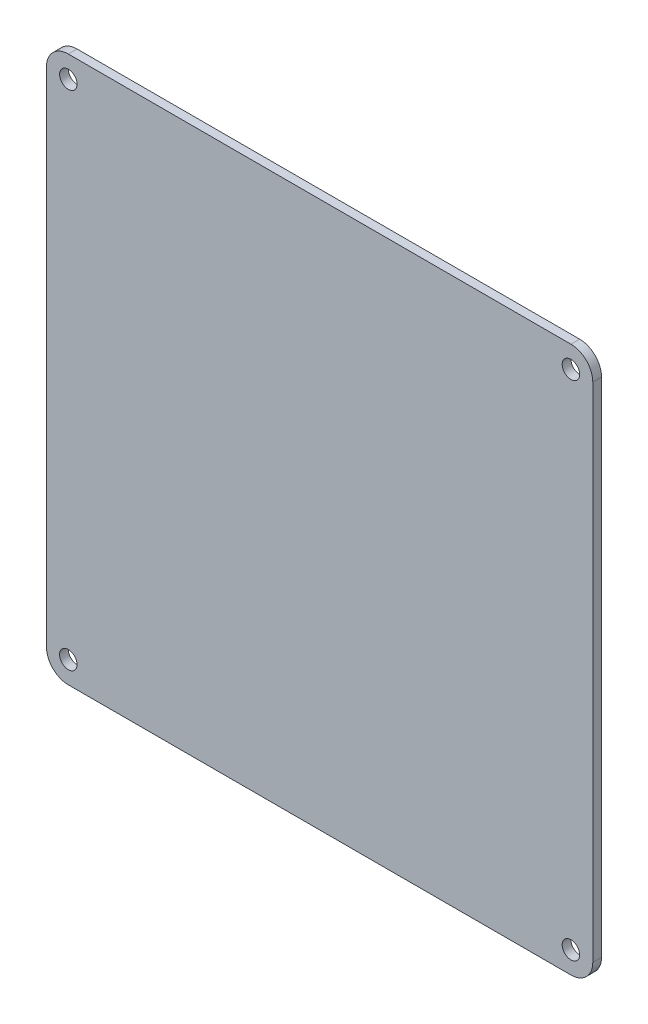
ISO-10303-21;
HEADER;
FILE_DESCRIPTION(('STEP AP214'),'2;1');
FILE_NAME('part.step','',(''),(''),'','','');
FILE_SCHEMA(('AUTOMOTIVE_DESIGN { 1 0 10303 214 1 1 1 1 }'));
ENDSEC;
DATA;
#1=APPLICATION_CONTEXT('core data for automotive mechanical design processes');
#2=APPLICATION_PROTOCOL_DEFINITION('international standard','automotive_design',2000,#1);
#3=PRODUCT_CONTEXT('',#1,'mechanical');
#4=PRODUCT('Part','Part','',(#3));
#5=PRODUCT_RELATED_PRODUCT_CATEGORY('part','',(#4));
#6=PRODUCT_DEFINITION_FORMATION('','',#4);
#7=PRODUCT_DEFINITION_CONTEXT('part definition',#1,'design');
#8=PRODUCT_DEFINITION('design','',#6,#7);
#9=PRODUCT_DEFINITION_SHAPE('','',#8);
#10=(LENGTH_UNIT() NAMED_UNIT(*) SI_UNIT(.MILLI.,.METRE.));
#11=(NAMED_UNIT(*) PLANE_ANGLE_UNIT() SI_UNIT($,.RADIAN.));
#12=(NAMED_UNIT(*) SI_UNIT($,.STERADIAN.) SOLID_ANGLE_UNIT());
#13=UNCERTAINTY_MEASURE_WITH_UNIT(LENGTH_MEASURE(1.E-05),#10,'distance_accuracy_value','');
#14=(GEOMETRIC_REPRESENTATION_CONTEXT(3) GLOBAL_UNCERTAINTY_ASSIGNED_CONTEXT((#13)) GLOBAL_UNIT_ASSIGNED_CONTEXT((#10,
#11,#12)) REPRESENTATION_CONTEXT('',''));
#15=CARTESIAN_POINT('',(0.,0.,0.));
#16=DIRECTION('',(0.,0.,1.));
#17=DIRECTION('',(1.,0.,0.));
#18=AXIS2_PLACEMENT_3D('',#15,#16,#17);
#19=CARTESIAN_POINT('',(46.,-46.,1.6));
#20=DIRECTION('',(0.,0.,-1.));
#21=DIRECTION('',(-1.,0.,0.));
#22=AXIS2_PLACEMENT_3D('',#19,#20,#21);
#23=PLANE('',#22);
#24=CARTESIAN_POINT('',(46.,-46.,1.6));
#25=DIRECTION('',(0.,0.,1.));
#26=DIRECTION('',(-1.,0.,0.));
#27=AXIS2_PLACEMENT_3D('',#24,#25,#26);
#28=CIRCLE('',#27,4.);
#29=CARTESIAN_POINT('',(46.,-50.,1.6));
#30=VERTEX_POINT('',#29);
#31=CARTESIAN_POINT('',(50.,-46.,1.6));
#32=VERTEX_POINT('',#31);
#33=EDGE_CURVE('E164',#30,#32,#28,.T.);
#34=ORIENTED_EDGE('',*,*,#33,.T.);
#35=DIRECTION('',(0.,1.,0.));
#36=VECTOR('',#35,1.);
#37=CARTESIAN_POINT('',(50.,46.,1.6));
#38=LINE('',#37,#36);
#39=CARTESIAN_POINT('',(50.,46.,1.6));
#40=VERTEX_POINT('',#39);
#41=EDGE_CURVE('E100',#32,#40,#38,.T.);
#42=ORIENTED_EDGE('',*,*,#41,.T.);
#43=CARTESIAN_POINT('',(46.,46.,1.6));
#44=DIRECTION('',(0.,0.,1.));
#45=DIRECTION('',(1.,0.,0.));
#46=AXIS2_PLACEMENT_3D('',#43,#44,#45);
#47=CIRCLE('',#46,4.);
#48=CARTESIAN_POINT('',(46.,50.,1.6));
#49=VERTEX_POINT('',#48);
#50=EDGE_CURVE('E185',#40,#49,#47,.T.);
#51=ORIENTED_EDGE('',*,*,#50,.T.);
#52=DIRECTION('',(-1.,0.,0.));
#53=VECTOR('',#52,1.);
#54=CARTESIAN_POINT('',(-46.,50.,1.6));
#55=LINE('',#54,#53);
#56=CARTESIAN_POINT('',(-46.,50.,1.6));
#57=VERTEX_POINT('',#56);
#58=EDGE_CURVE('E199',#49,#57,#55,.T.);
#59=ORIENTED_EDGE('',*,*,#58,.T.);
#60=CARTESIAN_POINT('',(-46.,46.,1.6));
#61=DIRECTION('',(0.,0.,1.));
#62=DIRECTION('',(-1.,0.,0.));
#63=AXIS2_PLACEMENT_3D('',#60,#61,#62);
#64=CIRCLE('',#63,4.);
#65=CARTESIAN_POINT('',(-50.,46.,1.6));
#66=VERTEX_POINT('',#65);
#67=EDGE_CURVE('E119',#57,#66,#64,.T.);
#68=ORIENTED_EDGE('',*,*,#67,.T.);
#69=DIRECTION('',(0.,-1.,0.));
#70=VECTOR('',#69,1.);
#71=CARTESIAN_POINT('',(-50.,46.,1.6));
#72=LINE('',#71,#70);
#73=CARTESIAN_POINT('',(-50.,-46.,1.6));
#74=VERTEX_POINT('',#73);
#75=EDGE_CURVE('E113',#66,#74,#72,.T.);
#76=ORIENTED_EDGE('',*,*,#75,.T.);
#77=CARTESIAN_POINT('',(-46.,-46.,1.6));
#78=DIRECTION('',(0.,0.,1.));
#79=DIRECTION('',(1.,0.,0.));
#80=AXIS2_PLACEMENT_3D('',#77,#78,#79);
#81=CIRCLE('',#80,4.);
#82=CARTESIAN_POINT('',(-46.,-50.,1.6));
#83=VERTEX_POINT('',#82);
#84=EDGE_CURVE('E117',#74,#83,#81,.T.);
#85=ORIENTED_EDGE('',*,*,#84,.T.);
#86=DIRECTION('',(1.,0.,0.));
#87=VECTOR('',#86,1.);
#88=CARTESIAN_POINT('',(-46.,-50.,1.6));
#89=LINE('',#88,#87);
#90=EDGE_CURVE('E57',#83,#30,#89,.T.);
#91=ORIENTED_EDGE('',*,*,#90,.T.);
#92=EDGE_LOOP('',(#34,#42,#51,#59,#68,#76,#85,#91));
#93=FACE_BOUND('',#92,.T.);
#94=CARTESIAN_POINT('',(46.,46.,1.6));
#95=DIRECTION('',(0.,0.,1.));
#96=DIRECTION('',(1.,0.,0.));
#97=AXIS2_PLACEMENT_3D('',#94,#95,#96);
#98=CIRCLE('',#97,1.6);
#99=CARTESIAN_POINT('',(47.6,46.,1.6));
#100=VERTEX_POINT('',#99);
#101=EDGE_CURVE('E146',#100,#100,#98,.T.);
#102=ORIENTED_EDGE('',*,*,#101,.F.);
#103=EDGE_LOOP('',(#102));
#104=FACE_BOUND('',#103,.T.);
#105=CARTESIAN_POINT('',(46.,-46.,1.6));
#106=DIRECTION('',(0.,0.,1.));
#107=DIRECTION('',(-1.,0.,0.));
#108=AXIS2_PLACEMENT_3D('',#105,#106,#107);
#109=CIRCLE('',#108,1.6);
#110=CARTESIAN_POINT('',(44.4,-46.,1.6));
#111=VERTEX_POINT('',#110);
#112=EDGE_CURVE('E213',#111,#111,#109,.T.);
#113=ORIENTED_EDGE('',*,*,#112,.F.);
#114=EDGE_LOOP('',(#113));
#115=FACE_BOUND('',#114,.T.);
#116=CARTESIAN_POINT('',(-46.,-46.,1.6));
#117=DIRECTION('',(0.,0.,1.));
#118=DIRECTION('',(1.,0.,0.));
#119=AXIS2_PLACEMENT_3D('',#116,#117,#118);
#120=CIRCLE('',#119,1.6);
#121=CARTESIAN_POINT('',(-44.4,-46.,1.6));
#122=VERTEX_POINT('',#121);
#123=EDGE_CURVE('E221',#122,#122,#120,.T.);
#124=ORIENTED_EDGE('',*,*,#123,.F.);
#125=EDGE_LOOP('',(#124));
#126=FACE_BOUND('',#125,.T.);
#127=CARTESIAN_POINT('',(-46.,46.,1.6));
#128=DIRECTION('',(0.,0.,1.));
#129=DIRECTION('',(-1.,0.,0.));
#130=AXIS2_PLACEMENT_3D('',#127,#128,#129);
#131=CIRCLE('',#130,1.6);
#132=CARTESIAN_POINT('',(-47.6,46.,1.6));
#133=VERTEX_POINT('',#132);
#134=EDGE_CURVE('E229',#133,#133,#131,.T.);
#135=ORIENTED_EDGE('',*,*,#134,.F.);
#136=EDGE_LOOP('',(#135));
#137=FACE_BOUND('',#136,.T.);
#138=ADVANCED_FACE('F39',(#93,#104,#115,#126,#137),#23,.F.);
#139=CARTESIAN_POINT('',(46.,-46.,0.));
#140=DIRECTION('',(0.,0.,-1.));
#141=DIRECTION('',(-1.,0.,0.));
#142=AXIS2_PLACEMENT_3D('',#139,#140,#141);
#143=PLANE('',#142);
#144=CARTESIAN_POINT('',(-46.,-46.,0.));
#145=DIRECTION('',(0.,0.,1.));
#146=DIRECTION('',(1.,0.,0.));
#147=AXIS2_PLACEMENT_3D('',#144,#145,#146);
#148=CIRCLE('',#147,1.6);
#149=CARTESIAN_POINT('',(-44.4,-46.,0.));
#150=VERTEX_POINT('',#149);
#151=EDGE_CURVE('E225',#150,#150,#148,.T.);
#152=ORIENTED_EDGE('',*,*,#151,.T.);
#153=EDGE_LOOP('',(#152));
#154=FACE_BOUND('',#153,.T.);
#155=CARTESIAN_POINT('',(46.,46.,0.));
#156=DIRECTION('',(0.,0.,1.));
#157=DIRECTION('',(1.,0.,0.));
#158=AXIS2_PLACEMENT_3D('',#155,#156,#157);
#159=CIRCLE('',#158,1.6);
#160=CARTESIAN_POINT('',(47.6,46.,0.));
#161=VERTEX_POINT('',#160);
#162=EDGE_CURVE('E209',#161,#161,#159,.T.);
#163=ORIENTED_EDGE('',*,*,#162,.T.);
#164=EDGE_LOOP('',(#163));
#165=FACE_BOUND('',#164,.T.);
#166=CARTESIAN_POINT('',(46.,-46.,0.));
#167=DIRECTION('',(0.,0.,1.));
#168=DIRECTION('',(-1.,0.,0.));
#169=AXIS2_PLACEMENT_3D('',#166,#167,#168);
#170=CIRCLE('',#169,4.);
#171=CARTESIAN_POINT('',(46.,-50.,0.));
#172=VERTEX_POINT('',#171);
#173=CARTESIAN_POINT('',(50.,-46.,0.));
#174=VERTEX_POINT('',#173);
#175=EDGE_CURVE('E141',#172,#174,#170,.T.);
#176=ORIENTED_EDGE('',*,*,#175,.F.);
#177=DIRECTION('',(1.,0.,0.));
#178=VECTOR('',#177,1.);
#179=CARTESIAN_POINT('',(-46.,-50.,0.));
#180=LINE('',#179,#178);
#181=CARTESIAN_POINT('',(-46.,-50.,0.));
#182=VERTEX_POINT('',#181);
#183=EDGE_CURVE('E92',#182,#172,#180,.T.);
#184=ORIENTED_EDGE('',*,*,#183,.F.);
#185=CARTESIAN_POINT('',(-46.,-46.,0.));
#186=DIRECTION('',(0.,0.,1.));
#187=DIRECTION('',(1.,0.,0.));
#188=AXIS2_PLACEMENT_3D('',#185,#186,#187);
#189=CIRCLE('',#188,4.);
#190=CARTESIAN_POINT('',(-50.,-46.,0.));
#191=VERTEX_POINT('',#190);
#192=EDGE_CURVE('E86',#191,#182,#189,.T.);
#193=ORIENTED_EDGE('',*,*,#192,.F.);
#194=DIRECTION('',(0.,-1.,0.));
#195=VECTOR('',#194,1.);
#196=CARTESIAN_POINT('',(-50.,46.,0.));
#197=LINE('',#196,#195);
#198=CARTESIAN_POINT('',(-50.,46.,0.));
#199=VERTEX_POINT('',#198);
#200=EDGE_CURVE('E128',#199,#191,#197,.T.);
#201=ORIENTED_EDGE('',*,*,#200,.F.);
#202=CARTESIAN_POINT('',(-46.,46.,0.));
#203=DIRECTION('',(0.,0.,1.));
#204=DIRECTION('',(-1.,0.,0.));
#205=AXIS2_PLACEMENT_3D('',#202,#203,#204);
#206=CIRCLE('',#205,4.);
#207=CARTESIAN_POINT('',(-46.,50.,0.));
#208=VERTEX_POINT('',#207);
#209=EDGE_CURVE('E155',#208,#199,#206,.T.);
#210=ORIENTED_EDGE('',*,*,#209,.F.);
#211=DIRECTION('',(-1.,0.,0.));
#212=VECTOR('',#211,1.);
#213=CARTESIAN_POINT('',(-46.,50.,0.));
#214=LINE('',#213,#212);
#215=CARTESIAN_POINT('',(46.,50.,0.));
#216=VERTEX_POINT('',#215);
#217=EDGE_CURVE('E152',#216,#208,#214,.T.);
#218=ORIENTED_EDGE('',*,*,#217,.F.);
#219=CARTESIAN_POINT('',(46.,46.,0.));
#220=DIRECTION('',(0.,0.,1.));
#221=DIRECTION('',(1.,0.,0.));
#222=AXIS2_PLACEMENT_3D('',#219,#220,#221);
#223=CIRCLE('',#222,4.);
#224=CARTESIAN_POINT('',(50.,46.,0.));
#225=VERTEX_POINT('',#224);
#226=EDGE_CURVE('E149',#225,#216,#223,.T.);
#227=ORIENTED_EDGE('',*,*,#226,.F.);
#228=DIRECTION('',(0.,1.,0.));
#229=VECTOR('',#228,1.);
#230=CARTESIAN_POINT('',(50.,46.,0.));
#231=LINE('',#230,#229);
#232=EDGE_CURVE('E145',#174,#225,#231,.T.);
#233=ORIENTED_EDGE('',*,*,#232,.F.);
#234=EDGE_LOOP('',(#176,#184,#193,#201,#210,#218,#227,#233));
#235=FACE_BOUND('',#234,.T.);
#236=CARTESIAN_POINT('',(46.,-46.,0.));
#237=DIRECTION('',(0.,0.,1.));
#238=DIRECTION('',(-1.,0.,0.));
#239=AXIS2_PLACEMENT_3D('',#236,#237,#238);
#240=CIRCLE('',#239,1.6);
#241=CARTESIAN_POINT('',(44.4,-46.,0.));
#242=VERTEX_POINT('',#241);
#243=EDGE_CURVE('E217',#242,#242,#240,.T.);
#244=ORIENTED_EDGE('',*,*,#243,.T.);
#245=EDGE_LOOP('',(#244));
#246=FACE_BOUND('',#245,.T.);
#247=CARTESIAN_POINT('',(-46.,46.,0.));
#248=DIRECTION('',(0.,0.,1.));
#249=DIRECTION('',(-1.,0.,0.));
#250=AXIS2_PLACEMENT_3D('',#247,#248,#249);
#251=CIRCLE('',#250,1.6);
#252=CARTESIAN_POINT('',(-47.6,46.,0.));
#253=VERTEX_POINT('',#252);
#254=EDGE_CURVE('E233',#253,#253,#251,.T.);
#255=ORIENTED_EDGE('',*,*,#254,.T.);
#256=EDGE_LOOP('',(#255));
#257=FACE_BOUND('',#256,.T.);
#258=ADVANCED_FACE('F189',(#154,#165,#235,#246,#257),#143,.T.);
#259=CARTESIAN_POINT('',(46.,-46.,1.6));
#260=DIRECTION('',(0.,0.,-1.));
#261=DIRECTION('',(-1.,0.,0.));
#262=AXIS2_PLACEMENT_3D('',#259,#260,#261);
#263=CYLINDRICAL_SURFACE('',#262,4.);
#264=ORIENTED_EDGE('',*,*,#175,.T.);
#265=DIRECTION('',(0.,0.,-1.));
#266=VECTOR('',#265,1.);
#267=CARTESIAN_POINT('',(50.,-46.,1.6));
#268=LINE('',#267,#266);
#269=EDGE_CURVE('E11',#32,#174,#268,.T.);
#270=ORIENTED_EDGE('',*,*,#269,.F.);
#271=ORIENTED_EDGE('',*,*,#33,.F.);
#272=DIRECTION('',(0.,0.,-1.));
#273=VECTOR('',#272,1.);
#274=CARTESIAN_POINT('',(46.,-50.,1.6));
#275=LINE('',#274,#273);
#276=EDGE_CURVE('E137',#30,#172,#275,.T.);
#277=ORIENTED_EDGE('',*,*,#276,.T.);
#278=EDGE_LOOP('',(#264,#270,#271,#277));
#279=FACE_BOUND('',#278,.T.);
#280=ADVANCED_FACE('F41',(#279),#263,.T.);
#281=CARTESIAN_POINT('',(50.,46.,1.6));
#282=DIRECTION('',(-1.,0.,0.));
#283=DIRECTION('',(0.,0.,1.));
#284=AXIS2_PLACEMENT_3D('',#281,#282,#283);
#285=PLANE('',#284);
#286=ORIENTED_EDGE('',*,*,#232,.T.);
#287=DIRECTION('',(0.,0.,-1.));
#288=VECTOR('',#287,1.);
#289=CARTESIAN_POINT('',(50.,46.,1.6));
#290=LINE('',#289,#288);
#291=EDGE_CURVE('E49',#40,#225,#290,.T.);
#292=ORIENTED_EDGE('',*,*,#291,.F.);
#293=ORIENTED_EDGE('',*,*,#41,.F.);
#294=ORIENTED_EDGE('',*,*,#269,.T.);
#295=EDGE_LOOP('',(#286,#292,#293,#294));
#296=FACE_BOUND('',#295,.T.);
#297=ADVANCED_FACE('F267',(#296),#285,.F.);
#298=CARTESIAN_POINT('',(46.,46.,1.6));
#299=DIRECTION('',(0.,0.,-1.));
#300=DIRECTION('',(-1.,0.,0.));
#301=AXIS2_PLACEMENT_3D('',#298,#299,#300);
#302=CYLINDRICAL_SURFACE('',#301,4.);
#303=ORIENTED_EDGE('',*,*,#226,.T.);
#304=DIRECTION('',(0.,0.,-1.));
#305=VECTOR('',#304,1.);
#306=CARTESIAN_POINT('',(46.,50.,1.6));
#307=LINE('',#306,#305);
#308=EDGE_CURVE('E175',#49,#216,#307,.T.);
#309=ORIENTED_EDGE('',*,*,#308,.F.);
#310=ORIENTED_EDGE('',*,*,#50,.F.);
#311=ORIENTED_EDGE('',*,*,#291,.T.);
#312=EDGE_LOOP('',(#303,#309,#310,#311));
#313=FACE_BOUND('',#312,.T.);
#314=ADVANCED_FACE('F183',(#313),#302,.T.);
#315=CARTESIAN_POINT('',(-46.,50.,1.6));
#316=DIRECTION('',(0.,-1.,0.));
#317=DIRECTION('',(0.,0.,-1.));
#318=AXIS2_PLACEMENT_3D('',#315,#316,#317);
#319=PLANE('',#318);
#320=ORIENTED_EDGE('',*,*,#217,.T.);
#321=DIRECTION('',(0.,0.,-1.));
#322=VECTOR('',#321,1.);
#323=CARTESIAN_POINT('',(-46.,50.,1.6));
#324=LINE('',#323,#322);
#325=EDGE_CURVE('E171',#57,#208,#324,.T.);
#326=ORIENTED_EDGE('',*,*,#325,.F.);
#327=ORIENTED_EDGE('',*,*,#58,.F.);
#328=ORIENTED_EDGE('',*,*,#308,.T.);
#329=EDGE_LOOP('',(#320,#326,#327,#328));
#330=FACE_BOUND('',#329,.T.);
#331=ADVANCED_FACE('F194',(#330),#319,.F.);
#332=CARTESIAN_POINT('',(-46.,46.,1.6));
#333=DIRECTION('',(0.,0.,-1.));
#334=DIRECTION('',(-1.,0.,0.));
#335=AXIS2_PLACEMENT_3D('',#332,#333,#334);
#336=CYLINDRICAL_SURFACE('',#335,4.);
#337=ORIENTED_EDGE('',*,*,#209,.T.);
#338=DIRECTION('',(0.,0.,-1.));
#339=VECTOR('',#338,1.);
#340=CARTESIAN_POINT('',(-50.,46.,1.6));
#341=LINE('',#340,#339);
#342=EDGE_CURVE('E130',#66,#199,#341,.T.);
#343=ORIENTED_EDGE('',*,*,#342,.F.);
#344=ORIENTED_EDGE('',*,*,#67,.F.);
#345=ORIENTED_EDGE('',*,*,#325,.T.);
#346=EDGE_LOOP('',(#337,#343,#344,#345));
#347=FACE_BOUND('',#346,.T.);
#348=ADVANCED_FACE('F197',(#347),#336,.T.);
#349=CARTESIAN_POINT('',(-50.,46.,1.6));
#350=DIRECTION('',(1.,0.,0.));
#351=DIRECTION('',(0.,0.,-1.));
#352=AXIS2_PLACEMENT_3D('',#349,#350,#351);
#353=PLANE('',#352);
#354=ORIENTED_EDGE('',*,*,#200,.T.);
#355=DIRECTION('',(0.,0.,-1.));
#356=VECTOR('',#355,1.);
#357=CARTESIAN_POINT('',(-50.,-46.,1.6));
#358=LINE('',#357,#356);
#359=EDGE_CURVE('E125',#74,#191,#358,.T.);
#360=ORIENTED_EDGE('',*,*,#359,.F.);
#361=ORIENTED_EDGE('',*,*,#75,.F.);
#362=ORIENTED_EDGE('',*,*,#342,.T.);
#363=EDGE_LOOP('',(#354,#360,#361,#362));
#364=FACE_BOUND('',#363,.T.);
#365=ADVANCED_FACE('F126',(#364),#353,.F.);
#366=CARTESIAN_POINT('',(-46.,-46.,1.6));
#367=DIRECTION('',(0.,0.,-1.));
#368=DIRECTION('',(-1.,0.,0.));
#369=AXIS2_PLACEMENT_3D('',#366,#367,#368);
#370=CYLINDRICAL_SURFACE('',#369,4.);
#371=ORIENTED_EDGE('',*,*,#192,.T.);
#372=DIRECTION('',(0.,0.,-1.));
#373=VECTOR('',#372,1.);
#374=CARTESIAN_POINT('',(-46.,-50.,1.6));
#375=LINE('',#374,#373);
#376=EDGE_CURVE('E131',#83,#182,#375,.T.);
#377=ORIENTED_EDGE('',*,*,#376,.F.);
#378=ORIENTED_EDGE('',*,*,#84,.F.);
#379=ORIENTED_EDGE('',*,*,#359,.T.);
#380=EDGE_LOOP('',(#371,#377,#378,#379));
#381=FACE_BOUND('',#380,.T.);
#382=ADVANCED_FACE('F133',(#381),#370,.T.);
#383=CARTESIAN_POINT('',(-46.,-50.,1.6));
#384=DIRECTION('',(0.,1.,0.));
#385=DIRECTION('',(0.,0.,1.));
#386=AXIS2_PLACEMENT_3D('',#383,#384,#385);
#387=PLANE('',#386);
#388=ORIENTED_EDGE('',*,*,#183,.T.);
#389=ORIENTED_EDGE('',*,*,#276,.F.);
#390=ORIENTED_EDGE('',*,*,#90,.F.);
#391=ORIENTED_EDGE('',*,*,#376,.T.);
#392=EDGE_LOOP('',(#388,#389,#390,#391));
#393=FACE_BOUND('',#392,.T.);
#394=ADVANCED_FACE('F255',(#393),#387,.F.);
#395=CARTESIAN_POINT('',(46.,46.,1.6));
#396=DIRECTION('',(0.,0.,-1.));
#397=DIRECTION('',(-1.,0.,0.));
#398=AXIS2_PLACEMENT_3D('',#395,#396,#397);
#399=CYLINDRICAL_SURFACE('',#398,1.6);
#400=ORIENTED_EDGE('',*,*,#101,.T.);
#401=EDGE_LOOP('',(#400));
#402=FACE_BOUND('',#401,.T.);
#403=ORIENTED_EDGE('',*,*,#162,.F.);
#404=EDGE_LOOP('',(#403));
#405=FACE_BOUND('',#404,.T.);
#406=ADVANCED_FACE('F252',(#402,#405),#399,.F.);
#407=CARTESIAN_POINT('',(46.,-46.,1.6));
#408=DIRECTION('',(0.,0.,-1.));
#409=DIRECTION('',(-1.,0.,0.));
#410=AXIS2_PLACEMENT_3D('',#407,#408,#409);
#411=CYLINDRICAL_SURFACE('',#410,1.6);
#412=ORIENTED_EDGE('',*,*,#112,.T.);
#413=EDGE_LOOP('',(#412));
#414=FACE_BOUND('',#413,.T.);
#415=ORIENTED_EDGE('',*,*,#243,.F.);
#416=EDGE_LOOP('',(#415));
#417=FACE_BOUND('',#416,.T.);
#418=ADVANCED_FACE('F331',(#414,#417),#411,.F.);
#419=CARTESIAN_POINT('',(-46.,-46.,1.6));
#420=DIRECTION('',(0.,0.,-1.));
#421=DIRECTION('',(-1.,0.,0.));
#422=AXIS2_PLACEMENT_3D('',#419,#420,#421);
#423=CYLINDRICAL_SURFACE('',#422,1.6);
#424=ORIENTED_EDGE('',*,*,#123,.T.);
#425=EDGE_LOOP('',(#424));
#426=FACE_BOUND('',#425,.T.);
#427=ORIENTED_EDGE('',*,*,#151,.F.);
#428=EDGE_LOOP('',(#427));
#429=FACE_BOUND('',#428,.T.);
#430=ADVANCED_FACE('F339',(#426,#429),#423,.F.);
#431=CARTESIAN_POINT('',(-46.,46.,1.6));
#432=DIRECTION('',(0.,0.,-1.));
#433=DIRECTION('',(-1.,0.,0.));
#434=AXIS2_PLACEMENT_3D('',#431,#432,#433);
#435=CYLINDRICAL_SURFACE('',#434,1.6);
#436=ORIENTED_EDGE('',*,*,#134,.T.);
#437=EDGE_LOOP('',(#436));
#438=FACE_BOUND('',#437,.T.);
#439=ORIENTED_EDGE('',*,*,#254,.F.);
#440=EDGE_LOOP('',(#439));
#441=FACE_BOUND('',#440,.T.);
#442=ADVANCED_FACE('F241',(#438,#441),#435,.F.);
#443=CLOSED_SHELL('',(#138,#258,#280,#297,#314,#331,#348,#365,#382,#394,#406,#418,#430,#442));
#444=MANIFOLD_SOLID_BREP('B2',#443);
#445=ADVANCED_BREP_SHAPE_REPRESENTATION('',(#18,#444),#14);
#446=SHAPE_DEFINITION_REPRESENTATION(#9,#445);
ENDSEC;
END-ISO-10303-21;
